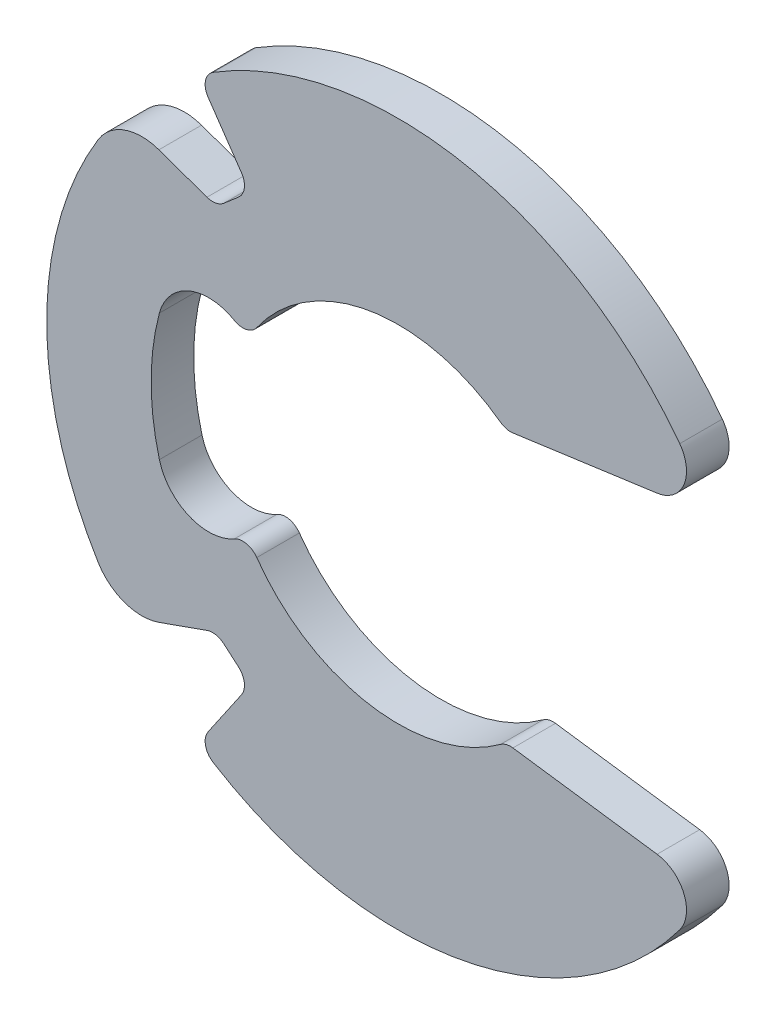
ISO-10303-21;
HEADER;
FILE_DESCRIPTION(('STEP AP214'),'2;1');
FILE_NAME('part.step','',(''),(''),'','','');
FILE_SCHEMA(('AUTOMOTIVE_DESIGN { 1 0 10303 214 1 1 1 1 }'));
ENDSEC;
DATA;
#1=APPLICATION_CONTEXT('core data for automotive mechanical design processes');
#2=APPLICATION_PROTOCOL_DEFINITION('international standard','automotive_design',2000,#1);
#3=PRODUCT_CONTEXT('',#1,'mechanical');
#4=PRODUCT('Part','Part','',(#3));
#5=PRODUCT_RELATED_PRODUCT_CATEGORY('part','',(#4));
#6=PRODUCT_DEFINITION_FORMATION('','',#4);
#7=PRODUCT_DEFINITION_CONTEXT('part definition',#1,'design');
#8=PRODUCT_DEFINITION('design','',#6,#7);
#9=PRODUCT_DEFINITION_SHAPE('','',#8);
#10=(LENGTH_UNIT() NAMED_UNIT(*) SI_UNIT(.MILLI.,.METRE.));
#11=(NAMED_UNIT(*) PLANE_ANGLE_UNIT() SI_UNIT($,.RADIAN.));
#12=(NAMED_UNIT(*) SI_UNIT($,.STERADIAN.) SOLID_ANGLE_UNIT());
#13=UNCERTAINTY_MEASURE_WITH_UNIT(LENGTH_MEASURE(1.E-05),#10,'distance_accuracy_value','');
#14=(GEOMETRIC_REPRESENTATION_CONTEXT(3) GLOBAL_UNCERTAINTY_ASSIGNED_CONTEXT((#13)) GLOBAL_UNIT_ASSIGNED_CONTEXT((#10,
#11,#12)) REPRESENTATION_CONTEXT('',''));
#15=CARTESIAN_POINT('',(0.,0.,0.));
#16=DIRECTION('',(0.,0.,1.));
#17=DIRECTION('',(1.,0.,0.));
#18=AXIS2_PLACEMENT_3D('',#15,#16,#17);
#19=CARTESIAN_POINT('',(0.,0.,1.27));
#20=DIRECTION('',(0.,0.,-1.));
#21=DIRECTION('',(-1.,0.,0.));
#22=AXIS2_PLACEMENT_3D('',#19,#20,#21);
#23=PLANE('',#22);
#24=CARTESIAN_POINT('',(7.57687706687955,-5.66664946537147,1.27));
#25=DIRECTION('',(0.,0.,-1.));
#26=DIRECTION('',(-1.,0.,0.));
#27=AXIS2_PLACEMENT_3D('',#24,#25,#26);
#28=CIRCLE('',#27,1.016);
#29=CARTESIAN_POINT('',(7.71621548730133,-4.66024954258016,1.27));
#30=VERTEX_POINT('',#29);
#31=CARTESIAN_POINT('',(8.39050144990017,-6.27514873682076,1.27));
#32=VERTEX_POINT('',#31);
#33=EDGE_CURVE('E483',#30,#32,#28,.T.);
#34=ORIENTED_EDGE('',*,*,#33,.F.);
#35=DIRECTION('',(0.990551105109562,-0.137144114588364,0.));
#36=VECTOR('',#35,1.);
#37=CARTESIAN_POINT('',(0.,-3.59192148204873,1.27));
#38=LINE('',#37,#36);
#39=CARTESIAN_POINT('',(3.41825205926127,-4.06518646523744,1.27));
#40=VERTEX_POINT('',#39);
#41=EDGE_CURVE('E485',#30,#40,#38,.F.);
#42=ORIENTED_EDGE('',*,*,#41,.T.);
#43=CARTESIAN_POINT('',(3.34858284905039,-4.5683864266331,1.27));
#44=DIRECTION('',(0.,0.,-1.));
#45=DIRECTION('',(-1.,0.,0.));
#46=AXIS2_PLACEMENT_3D('',#43,#44,#45);
#47=CIRCLE('',#46,0.508);
#48=CARTESIAN_POINT('',(3.04826151729699,-4.15866567088125,1.27));
#49=VERTEX_POINT('',#48);
#50=EDGE_CURVE('E19',#49,#40,#47,.T.);
#51=ORIENTED_EDGE('',*,*,#50,.F.);
#52=CARTESIAN_POINT('',(0.,0.,1.27));
#53=DIRECTION('',(0.,0.,-1.));
#54=DIRECTION('',(-1.,0.,0.));
#55=AXIS2_PLACEMENT_3D('',#52,#53,#54);
#56=CIRCLE('',#55,5.1562);
#57=CARTESIAN_POINT('',(-4.21618561440546,-2.96819428354689,1.27));
#58=VERTEX_POINT('',#57);
#59=EDGE_CURVE('E387',#49,#58,#56,.T.);
#60=ORIENTED_EDGE('',*,*,#59,.T.);
#61=CARTESIAN_POINT('',(-4.63157335966707,-3.26062721788648,1.27));
#62=DIRECTION('',(0.,0.,-1.));
#63=DIRECTION('',(-1.,0.,0.));
#64=AXIS2_PLACEMENT_3D('',#61,#62,#63);
#65=CIRCLE('',#64,0.508);
#66=CARTESIAN_POINT('',(-4.88521418696267,-2.82047913970278,1.27));
#67=VERTEX_POINT('',#66);
#68=EDGE_CURVE('E391',#67,#58,#65,.T.);
#69=ORIENTED_EDGE('',*,*,#68,.F.);
#70=CARTESIAN_POINT('',(-5.64613666884946,-1.50003490515168,1.27));
#71=DIRECTION('',(0.,0.,1.));
#72=DIRECTION('',(1.,0.,0.));
#73=AXIS2_PLACEMENT_3D('',#70,#71,#72);
#74=CIRCLE('',#73,1.524);
#75=CARTESIAN_POINT('',(-7.1190418868102,-1.89134835866951,1.27));
#76=VERTEX_POINT('',#75);
#77=EDGE_CURVE('E395',#67,#76,#74,.F.);
#78=ORIENTED_EDGE('',*,*,#77,.T.);
#79=CARTESIAN_POINT('',(0.,0.,1.27));
#80=DIRECTION('',(0.,0.,1.));
#81=DIRECTION('',(1.,0.,0.));
#82=AXIS2_PLACEMENT_3D('',#79,#80,#81);
#83=CIRCLE('',#82,7.366);
#84=CARTESIAN_POINT('',(-7.1190418868102,1.89134835866951,1.27));
#85=VERTEX_POINT('',#84);
#86=EDGE_CURVE('E400',#76,#85,#83,.F.);
#87=ORIENTED_EDGE('',*,*,#86,.T.);
#88=CARTESIAN_POINT('',(-5.64613666884946,1.50003490515168,1.27));
#89=DIRECTION('',(0.,0.,1.));
#90=DIRECTION('',(1.,0.,0.));
#91=AXIS2_PLACEMENT_3D('',#88,#89,#90);
#92=CIRCLE('',#91,1.524);
#93=CARTESIAN_POINT('',(-4.88521418696268,2.82047913970279,1.27));
#94=VERTEX_POINT('',#93);
#95=EDGE_CURVE('E405',#85,#94,#92,.F.);
#96=ORIENTED_EDGE('',*,*,#95,.T.);
#97=CARTESIAN_POINT('',(-4.63157335966708,3.26062721788649,1.27));
#98=DIRECTION('',(0.,0.,1.));
#99=DIRECTION('',(1.,0.,0.));
#100=AXIS2_PLACEMENT_3D('',#97,#98,#99);
#101=CIRCLE('',#100,0.508);
#102=CARTESIAN_POINT('',(-4.21618561440546,2.96819428354689,1.27));
#103=VERTEX_POINT('',#102);
#104=EDGE_CURVE('E408',#103,#94,#101,.F.);
#105=ORIENTED_EDGE('',*,*,#104,.F.);
#106=CARTESIAN_POINT('',(0.,0.,1.27));
#107=DIRECTION('',(0.,0.,-1.));
#108=DIRECTION('',(-1.,0.,0.));
#109=AXIS2_PLACEMENT_3D('',#106,#107,#108);
#110=CIRCLE('',#109,5.1562);
#111=CARTESIAN_POINT('',(3.048261517297,4.15866567088126,1.27));
#112=VERTEX_POINT('',#111);
#113=EDGE_CURVE('E413',#103,#112,#110,.T.);
#114=ORIENTED_EDGE('',*,*,#113,.T.);
#115=CARTESIAN_POINT('',(3.3485828490504,4.5683864266331,1.27));
#116=DIRECTION('',(0.,0.,-1.));
#117=DIRECTION('',(-1.,0.,0.));
#118=AXIS2_PLACEMENT_3D('',#115,#116,#117);
#119=CIRCLE('',#118,0.508);
#120=CARTESIAN_POINT('',(3.41825205926129,4.06518646523745,1.27));
#121=VERTEX_POINT('',#120);
#122=EDGE_CURVE('E418',#121,#112,#119,.T.);
#123=ORIENTED_EDGE('',*,*,#122,.F.);
#124=DIRECTION('',(-0.990551105109562,-0.137144114588364,0.));
#125=VECTOR('',#124,1.);
#126=CARTESIAN_POINT('',(11.2983179723503,5.15619999999999,1.27));
#127=LINE('',#126,#125);
#128=CARTESIAN_POINT('',(7.71621548730134,4.66024954258016,1.27));
#129=VERTEX_POINT('',#128);
#130=EDGE_CURVE('E426',#121,#129,#127,.F.);
#131=ORIENTED_EDGE('',*,*,#130,.T.);
#132=CARTESIAN_POINT('',(7.57687706687956,5.66664946537147,1.27));
#133=DIRECTION('',(0.,0.,-1.));
#134=DIRECTION('',(-1.,0.,0.));
#135=AXIS2_PLACEMENT_3D('',#132,#133,#134);
#136=CIRCLE('',#135,1.016);
#137=CARTESIAN_POINT('',(8.39050144990018,6.27514873682076,1.27));
#138=VERTEX_POINT('',#137);
#139=EDGE_CURVE('E422',#138,#129,#136,.T.);
#140=ORIENTED_EDGE('',*,*,#139,.F.);
#141=CARTESIAN_POINT('',(0.,0.,1.27));
#142=DIRECTION('',(0.,0.,-1.));
#143=DIRECTION('',(-1.,0.,0.));
#144=AXIS2_PLACEMENT_3D('',#141,#142,#143);
#145=CIRCLE('',#144,10.4775);
#146=CARTESIAN_POINT('',(-5.51465485817056,8.90879273780999,1.27));
#147=VERTEX_POINT('',#146);
#148=EDGE_CURVE('E428',#147,#138,#145,.T.);
#149=ORIENTED_EDGE('',*,*,#148,.F.);
#150=CARTESIAN_POINT('',(-5.24727765292592,8.47685127173435,1.27));
#151=DIRECTION('',(0.,0.,-1.));
#152=DIRECTION('',(-1.,0.,0.));
#153=AXIS2_PLACEMENT_3D('',#150,#151,#152);
#154=CIRCLE('',#153,0.508);
#155=CARTESIAN_POINT('',(-5.6664647231543,8.18989099547063,1.27));
#156=VERTEX_POINT('',#155);
#157=EDGE_CURVE('E432',#156,#147,#154,.T.);
#158=ORIENTED_EDGE('',*,*,#157,.F.);
#159=DIRECTION('',(0.564882433590001,-0.825171398087354,0.));
#160=VECTOR('',#159,1.);
#161=CARTESIAN_POINT('',(-7.96096866359448,11.541666359447,1.27));
#162=LINE('',#161,#160);
#163=CARTESIAN_POINT('',(-4.67174469224146,6.73681957776462,1.27));
#164=VERTEX_POINT('',#163);
#165=EDGE_CURVE('E498',#164,#156,#162,.F.);
#166=ORIENTED_EDGE('',*,*,#165,.F.);
#167=CARTESIAN_POINT('',(-5.09093176246983,6.4498593015009,1.27));
#168=DIRECTION('',(0.,0.,-1.));
#169=DIRECTION('',(-1.,0.,0.));
#170=AXIS2_PLACEMENT_3D('',#167,#168,#169);
#171=CIRCLE('',#170,0.508);
#172=CARTESIAN_POINT('',(-4.75923843445855,6.0650950410078,1.27000000000001));
#173=VERTEX_POINT('',#172);
#174=EDGE_CURVE('E437',#164,#173,#171,.T.);
#175=ORIENTED_EDGE('',*,*,#174,.T.);
#176=DIRECTION('',(-0.757409961600578,-0.652939622069462,0.));
#177=VECTOR('',#176,1.);
#178=CARTESIAN_POINT('',(-4.41503502304148,6.36182211981562,1.27000000000001));
#179=LINE('',#178,#177);
#180=CARTESIAN_POINT('',(-5.19974545035898,5.68534761350743,1.27000000000001));
#181=VERTEX_POINT('',#180);
#182=EDGE_CURVE('E503',#181,#173,#179,.F.);
#183=ORIENTED_EDGE('',*,*,#182,.F.);
#184=CARTESIAN_POINT('',(-5.53143877837027,6.07011187400052,1.27));
#185=DIRECTION('',(0.,0.,-1.));
#186=DIRECTION('',(-1.,0.,0.));
#187=AXIS2_PLACEMENT_3D('',#184,#185,#186);
#188=CIRCLE('',#187,0.508);
#189=CARTESIAN_POINT('',(-5.70123922502142,5.59133028672186,1.27));
#190=VERTEX_POINT('',#189);
#191=EDGE_CURVE('E442',#181,#190,#188,.T.);
#192=ORIENTED_EDGE('',*,*,#191,.T.);
#193=DIRECTION('',(-0.942483439524914,0.334252847738487,0.));
#194=VECTOR('',#193,1.);
#195=CARTESIAN_POINT('',(-5.42319262672811,5.49272073732714,1.27));
#196=LINE('',#195,#194);
#197=CARTESIAN_POINT('',(-7.13394241485243,6.09944013892937,1.27));
#198=VERTEX_POINT('',#197);
#199=EDGE_CURVE('E507',#198,#190,#196,.F.);
#200=ORIENTED_EDGE('',*,*,#199,.F.);
#201=CARTESIAN_POINT('',(-7.64334375480589,4.6630953770934,1.27));
#202=DIRECTION('',(0.,0.,-1.));
#203=DIRECTION('',(-1.,0.,0.));
#204=AXIS2_PLACEMENT_3D('',#201,#202,#203);
#205=CIRCLE('',#204,1.524);
#206=CARTESIAN_POINT('',(-8.94433843647498,5.45681373915185,1.27));
#207=VERTEX_POINT('',#206);
#208=EDGE_CURVE('E447',#207,#198,#205,.T.);
#209=ORIENTED_EDGE('',*,*,#208,.F.);
#210=CARTESIAN_POINT('',(0.,0.,1.27));
#211=DIRECTION('',(0.,0.,-1.));
#212=DIRECTION('',(-1.,0.,0.));
#213=AXIS2_PLACEMENT_3D('',#210,#211,#212);
#214=CIRCLE('',#213,10.4775);
#215=CARTESIAN_POINT('',(-8.94433843647497,-5.45681373915185,1.27));
#216=VERTEX_POINT('',#215);
#217=EDGE_CURVE('E452',#216,#207,#214,.T.);
#218=ORIENTED_EDGE('',*,*,#217,.F.);
#219=CARTESIAN_POINT('',(-7.64334375480588,-4.6630953770934,1.27));
#220=DIRECTION('',(0.,0.,-1.));
#221=DIRECTION('',(-1.,0.,0.));
#222=AXIS2_PLACEMENT_3D('',#219,#220,#221);
#223=CIRCLE('',#222,1.524);
#224=CARTESIAN_POINT('',(-7.13394241485243,-6.09944013892937,1.27));
#225=VERTEX_POINT('',#224);
#226=EDGE_CURVE('E457',#225,#216,#223,.T.);
#227=ORIENTED_EDGE('',*,*,#226,.F.);
#228=DIRECTION('',(-0.942483439524914,-0.334252847738487,0.));
#229=VECTOR('',#228,1.);
#230=CARTESIAN_POINT('',(-5.42319262672811,-5.49272073732714,1.27));
#231=LINE('',#230,#229);
#232=CARTESIAN_POINT('',(-5.70123922502142,-5.59133028672186,1.27));
#233=VERTEX_POINT('',#232);
#234=EDGE_CURVE('E511',#225,#233,#231,.F.);
#235=ORIENTED_EDGE('',*,*,#234,.T.);
#236=CARTESIAN_POINT('',(-5.53143877837027,-6.07011187400052,1.27));
#237=DIRECTION('',(0.,0.,-1.));
#238=DIRECTION('',(-1.,0.,0.));
#239=AXIS2_PLACEMENT_3D('',#236,#237,#238);
#240=CIRCLE('',#239,0.508);
#241=CARTESIAN_POINT('',(-5.19974545035898,-5.68534761350743,1.27000000000001));
#242=VERTEX_POINT('',#241);
#243=EDGE_CURVE('E463',#233,#242,#240,.T.);
#244=ORIENTED_EDGE('',*,*,#243,.T.);
#245=DIRECTION('',(-0.757409961600578,0.652939622069462,0.));
#246=VECTOR('',#245,1.);
#247=CARTESIAN_POINT('',(-4.41503502304148,-6.36182211981562,1.27000000000001));
#248=LINE('',#247,#246);
#249=CARTESIAN_POINT('',(-4.75923843445855,-6.0650950410078,1.27000000000001));
#250=VERTEX_POINT('',#249);
#251=EDGE_CURVE('E514',#242,#250,#248,.F.);
#252=ORIENTED_EDGE('',*,*,#251,.T.);
#253=CARTESIAN_POINT('',(-5.09093176246983,-6.4498593015009,1.27));
#254=DIRECTION('',(0.,0.,-1.));
#255=DIRECTION('',(-1.,0.,0.));
#256=AXIS2_PLACEMENT_3D('',#253,#254,#255);
#257=CIRCLE('',#256,0.508);
#258=CARTESIAN_POINT('',(-4.67174469224146,-6.73681957776462,1.27));
#259=VERTEX_POINT('',#258);
#260=EDGE_CURVE('E468',#250,#259,#257,.T.);
#261=ORIENTED_EDGE('',*,*,#260,.T.);
#262=DIRECTION('',(0.56488243359,0.825171398087354,0.));
#263=VECTOR('',#262,1.);
#264=CARTESIAN_POINT('',(-7.96096866359448,-11.541666359447,1.27));
#265=LINE('',#264,#263);
#266=CARTESIAN_POINT('',(-5.66646472315429,-8.18989099547062,1.27));
#267=VERTEX_POINT('',#266);
#268=EDGE_CURVE('E477',#259,#267,#265,.F.);
#269=ORIENTED_EDGE('',*,*,#268,.T.);
#270=CARTESIAN_POINT('',(-5.24727765292592,-8.47685127173434,1.27));
#271=DIRECTION('',(0.,0.,-1.));
#272=DIRECTION('',(-1.,0.,0.));
#273=AXIS2_PLACEMENT_3D('',#270,#271,#272);
#274=CIRCLE('',#273,0.508);
#275=CARTESIAN_POINT('',(-5.51465485817055,-8.90879273780997,1.27));
#276=VERTEX_POINT('',#275);
#277=EDGE_CURVE('E473',#276,#267,#274,.T.);
#278=ORIENTED_EDGE('',*,*,#277,.F.);
#279=CARTESIAN_POINT('',(0.,0.,1.27));
#280=DIRECTION('',(0.,0.,-1.));
#281=DIRECTION('',(-1.,0.,0.));
#282=AXIS2_PLACEMENT_3D('',#279,#280,#281);
#283=CIRCLE('',#282,10.4775);
#284=EDGE_CURVE('E479',#32,#276,#283,.T.);
#285=ORIENTED_EDGE('',*,*,#284,.F.);
#286=EDGE_LOOP('',(#34,#42,#51,#60,#69,#78,#87,#96,#105,#114,#123,#131,#140,#149,#158,#166,#175,
#183,#192,#200,#209,#218,#227,#235,#244,#252,#261,#269,#278,#285));
#287=FACE_BOUND('',#286,.T.);
#288=ADVANCED_FACE('F16',(#287),#23,.F.);
#289=CARTESIAN_POINT('',(0.,-3.59192148204873,-28.9774986298856));
#290=DIRECTION('',(-0.137144114588364,-0.990551105109562,0.));
#291=DIRECTION('',(0.990551105109562,-0.137144114588364,0.));
#292=AXIS2_PLACEMENT_3D('',#289,#290,#291);
#293=PLANE('',#292);
#294=DIRECTION('',(0.,0.,-1.));
#295=VECTOR('',#294,1.);
#296=CARTESIAN_POINT('',(7.71621548730133,-4.66024954258016,1.27));
#297=LINE('',#296,#295);
#298=CARTESIAN_POINT('',(7.71621548730133,-4.66024954258016,0.));
#299=VERTEX_POINT('',#298);
#300=EDGE_CURVE('E283',#299,#30,#297,.F.);
#301=ORIENTED_EDGE('',*,*,#300,.F.);
#302=DIRECTION('',(0.990551105109562,-0.137144114588363,0.));
#303=VECTOR('',#302,1.);
#304=CARTESIAN_POINT('',(3.41825205926127,-4.06518646523744,0.));
#305=LINE('',#304,#303);
#306=CARTESIAN_POINT('',(3.41825205926127,-4.06518646523744,0.));
#307=VERTEX_POINT('',#306);
#308=EDGE_CURVE('E278',#307,#299,#305,.T.);
#309=ORIENTED_EDGE('',*,*,#308,.F.);
#310=DIRECTION('',(0.,0.,-1.));
#311=VECTOR('',#310,1.);
#312=CARTESIAN_POINT('',(3.41825205926127,-4.06518646523744,1.27));
#313=LINE('',#312,#311);
#314=EDGE_CURVE('E281',#40,#307,#313,.T.);
#315=ORIENTED_EDGE('',*,*,#314,.F.);
#316=ORIENTED_EDGE('',*,*,#41,.F.);
#317=EDGE_LOOP('',(#301,#309,#315,#316));
#318=FACE_BOUND('',#317,.T.);
#319=ADVANCED_FACE('F279',(#318),#293,.F.);
#320=CARTESIAN_POINT('',(7.57687706687955,-5.66664946537147,1.27));
#321=DIRECTION('',(0.,0.,-1.));
#322=DIRECTION('',(-1.,0.,0.));
#323=AXIS2_PLACEMENT_3D('',#320,#321,#322);
#324=CYLINDRICAL_SURFACE('',#323,1.016);
#325=CARTESIAN_POINT('',(7.57687706687955,-5.66664946537147,0.));
#326=DIRECTION('',(0.,0.,-1.));
#327=DIRECTION('',(-1.,0.,0.));
#328=AXIS2_PLACEMENT_3D('',#325,#326,#327);
#329=CIRCLE('',#328,1.016);
#330=CARTESIAN_POINT('',(8.39050144990017,-6.27514873682076,0.));
#331=VERTEX_POINT('',#330);
#332=EDGE_CURVE('E288',#299,#331,#329,.T.);
#333=ORIENTED_EDGE('',*,*,#332,.F.);
#334=ORIENTED_EDGE('',*,*,#300,.T.);
#335=ORIENTED_EDGE('',*,*,#33,.T.);
#336=DIRECTION('',(0.,0.,-1.));
#337=VECTOR('',#336,1.);
#338=CARTESIAN_POINT('',(8.39050144990017,-6.27514873682076,1.27));
#339=LINE('',#338,#337);
#340=EDGE_CURVE('E482',#331,#32,#339,.F.);
#341=ORIENTED_EDGE('',*,*,#340,.F.);
#342=EDGE_LOOP('',(#333,#334,#335,#341));
#343=FACE_BOUND('',#342,.T.);
#344=ADVANCED_FACE('F537',(#343),#324,.T.);
#345=CARTESIAN_POINT('',(0.,0.,1.27));
#346=DIRECTION('',(0.,0.,-1.));
#347=DIRECTION('',(-1.,0.,0.));
#348=AXIS2_PLACEMENT_3D('',#345,#346,#347);
#349=CYLINDRICAL_SURFACE('',#348,10.4775);
#350=ORIENTED_EDGE('',*,*,#284,.T.);
#351=DIRECTION('',(0.,0.,-1.));
#352=VECTOR('',#351,1.);
#353=CARTESIAN_POINT('',(-5.51465485817055,-8.90879273780998,1.27));
#354=LINE('',#353,#352);
#355=CARTESIAN_POINT('',(-5.51465485817055,-8.90879273780997,0.));
#356=VERTEX_POINT('',#355);
#357=EDGE_CURVE('E478',#356,#276,#354,.F.);
#358=ORIENTED_EDGE('',*,*,#357,.F.);
#359=CARTESIAN_POINT('',(0.,0.,0.));
#360=DIRECTION('',(0.,0.,-1.));
#361=DIRECTION('',(-1.,0.,0.));
#362=AXIS2_PLACEMENT_3D('',#359,#360,#361);
#363=CIRCLE('',#362,10.4775);
#364=EDGE_CURVE('E381',#331,#356,#363,.T.);
#365=ORIENTED_EDGE('',*,*,#364,.F.);
#366=ORIENTED_EDGE('',*,*,#340,.T.);
#367=EDGE_LOOP('',(#350,#358,#365,#366));
#368=FACE_BOUND('',#367,.T.);
#369=ADVANCED_FACE('F536',(#368),#349,.T.);
#370=CARTESIAN_POINT('',(-5.24727765292592,-8.47685127173434,1.27));
#371=DIRECTION('',(0.,0.,-1.));
#372=DIRECTION('',(-1.,0.,0.));
#373=AXIS2_PLACEMENT_3D('',#370,#371,#372);
#374=CYLINDRICAL_SURFACE('',#373,0.508);
#375=DIRECTION('',(0.,0.,1.));
#376=VECTOR('',#375,1.);
#377=CARTESIAN_POINT('',(-5.66646472315429,-8.18989099547062,-28.9619533727259));
#378=LINE('',#377,#376);
#379=CARTESIAN_POINT('',(-5.6664647231543,-8.18989099547062,0.));
#380=VERTEX_POINT('',#379);
#381=EDGE_CURVE('E472',#267,#380,#378,.F.);
#382=ORIENTED_EDGE('',*,*,#381,.T.);
#383=CARTESIAN_POINT('',(-5.24727765292592,-8.47685127173434,0.));
#384=DIRECTION('',(0.,0.,-1.));
#385=DIRECTION('',(-1.,0.,0.));
#386=AXIS2_PLACEMENT_3D('',#383,#384,#385);
#387=CIRCLE('',#386,0.508);
#388=EDGE_CURVE('E378',#356,#380,#387,.T.);
#389=ORIENTED_EDGE('',*,*,#388,.F.);
#390=ORIENTED_EDGE('',*,*,#357,.T.);
#391=ORIENTED_EDGE('',*,*,#277,.T.);
#392=EDGE_LOOP('',(#382,#389,#390,#391));
#393=FACE_BOUND('',#392,.T.);
#394=ADVANCED_FACE('F539',(#393),#374,.T.);
#395=CARTESIAN_POINT('',(-7.96096866359448,-11.541666359447,-28.9619533727259));
#396=DIRECTION('',(0.825171398087354,-0.56488243359,0.));
#397=DIRECTION('',(0.56488243359,0.825171398087354,0.));
#398=AXIS2_PLACEMENT_3D('',#395,#396,#397);
#399=PLANE('',#398);
#400=ORIENTED_EDGE('',*,*,#381,.F.);
#401=ORIENTED_EDGE('',*,*,#268,.F.);
#402=DIRECTION('',(0.,0.,-1.));
#403=VECTOR('',#402,1.);
#404=CARTESIAN_POINT('',(-4.67174469224146,-6.73681957776462,-28.9619533727259));
#405=LINE('',#404,#403);
#406=CARTESIAN_POINT('',(-4.67174469224146,-6.73681957776462,0.));
#407=VERTEX_POINT('',#406);
#408=EDGE_CURVE('E471',#259,#407,#405,.T.);
#409=ORIENTED_EDGE('',*,*,#408,.T.);
#410=DIRECTION('',(0.564882433590003,0.825171398087353,0.));
#411=VECTOR('',#410,1.);
#412=CARTESIAN_POINT('',(-5.6664647231543,-8.18989099547062,0.));
#413=LINE('',#412,#411);
#414=EDGE_CURVE('E377',#380,#407,#413,.T.);
#415=ORIENTED_EDGE('',*,*,#414,.F.);
#416=EDGE_LOOP('',(#400,#401,#409,#415));
#417=FACE_BOUND('',#416,.T.);
#418=ADVANCED_FACE('F541',(#417),#399,.F.);
#419=CARTESIAN_POINT('',(-5.09093176246983,-6.4498593015009,-28.9619533727259));
#420=DIRECTION('',(0.,0.,-1.));
#421=DIRECTION('',(-1.,0.,0.));
#422=AXIS2_PLACEMENT_3D('',#419,#420,#421);
#423=CYLINDRICAL_SURFACE('',#422,0.508);
#424=ORIENTED_EDGE('',*,*,#408,.F.);
#425=ORIENTED_EDGE('',*,*,#260,.F.);
#426=DIRECTION('',(0.,0.,1.));
#427=VECTOR('',#426,1.);
#428=CARTESIAN_POINT('',(-4.75923843445855,-6.0650950410078,-28.9619533727259));
#429=LINE('',#428,#427);
#430=CARTESIAN_POINT('',(-4.75923843445855,-6.0650950410078,0.));
#431=VERTEX_POINT('',#430);
#432=EDGE_CURVE('E467',#250,#431,#429,.F.);
#433=ORIENTED_EDGE('',*,*,#432,.T.);
#434=CARTESIAN_POINT('',(-5.09093176246983,-6.4498593015009,0.));
#435=DIRECTION('',(0.,0.,-1.));
#436=DIRECTION('',(-1.,0.,0.));
#437=AXIS2_PLACEMENT_3D('',#434,#435,#436);
#438=CIRCLE('',#437,0.508);
#439=EDGE_CURVE('E373',#407,#431,#438,.F.);
#440=ORIENTED_EDGE('',*,*,#439,.F.);
#441=EDGE_LOOP('',(#424,#425,#433,#440));
#442=FACE_BOUND('',#441,.T.);
#443=ADVANCED_FACE('F608',(#442),#423,.F.);
#444=CARTESIAN_POINT('',(-4.41503502304148,-6.36182211981562,-28.9619533727259));
#445=DIRECTION('',(0.652939622069462,0.757409961600578,0.));
#446=DIRECTION('',(-0.757409961600578,0.652939622069462,0.));
#447=AXIS2_PLACEMENT_3D('',#444,#445,#446);
#448=PLANE('',#447);
#449=ORIENTED_EDGE('',*,*,#432,.F.);
#450=ORIENTED_EDGE('',*,*,#251,.F.);
#451=DIRECTION('',(0.,0.,-1.));
#452=VECTOR('',#451,1.);
#453=CARTESIAN_POINT('',(-5.19974545035899,-5.68534761350743,-28.9619533727259));
#454=LINE('',#453,#452);
#455=CARTESIAN_POINT('',(-5.19974545035898,-5.68534761350743,0.));
#456=VERTEX_POINT('',#455);
#457=EDGE_CURVE('E466',#242,#456,#454,.T.);
#458=ORIENTED_EDGE('',*,*,#457,.T.);
#459=DIRECTION('',(-0.757409961600581,0.652939622069458,0.));
#460=VECTOR('',#459,1.);
#461=CARTESIAN_POINT('',(-4.75923843445854,-6.0650950410078,0.));
#462=LINE('',#461,#460);
#463=EDGE_CURVE('E372',#431,#456,#462,.T.);
#464=ORIENTED_EDGE('',*,*,#463,.F.);
#465=EDGE_LOOP('',(#449,#450,#458,#464));
#466=FACE_BOUND('',#465,.T.);
#467=ADVANCED_FACE('F612',(#466),#448,.F.);
#468=CARTESIAN_POINT('',(-5.53143877837027,-6.07011187400052,-28.9619533727259));
#469=DIRECTION('',(0.,0.,-1.));
#470=DIRECTION('',(-1.,0.,0.));
#471=AXIS2_PLACEMENT_3D('',#468,#469,#470);
#472=CYLINDRICAL_SURFACE('',#471,0.508);
#473=ORIENTED_EDGE('',*,*,#457,.F.);
#474=ORIENTED_EDGE('',*,*,#243,.F.);
#475=DIRECTION('',(0.,0.,1.));
#476=VECTOR('',#475,1.);
#477=CARTESIAN_POINT('',(-5.70123922502142,-5.59133028672186,-28.9619533727259));
#478=LINE('',#477,#476);
#479=CARTESIAN_POINT('',(-5.70123922502142,-5.59133028672186,0.));
#480=VERTEX_POINT('',#479);
#481=EDGE_CURVE('E462',#233,#480,#478,.F.);
#482=ORIENTED_EDGE('',*,*,#481,.T.);
#483=CARTESIAN_POINT('',(-5.53143877837027,-6.07011187400052,0.));
#484=DIRECTION('',(0.,0.,-1.));
#485=DIRECTION('',(-1.,0.,0.));
#486=AXIS2_PLACEMENT_3D('',#483,#484,#485);
#487=CIRCLE('',#486,0.508);
#488=EDGE_CURVE('E368',#456,#480,#487,.F.);
#489=ORIENTED_EDGE('',*,*,#488,.F.);
#490=EDGE_LOOP('',(#473,#474,#482,#489));
#491=FACE_BOUND('',#490,.T.);
#492=ADVANCED_FACE('F620',(#491),#472,.F.);
#493=CARTESIAN_POINT('',(-5.42319262672811,-5.49272073732714,-28.9619533727259));
#494=DIRECTION('',(-0.334252847738487,0.942483439524914,0.));
#495=DIRECTION('',(-0.942483439524914,-0.334252847738487,0.));
#496=AXIS2_PLACEMENT_3D('',#493,#494,#495);
#497=PLANE('',#496);
#498=ORIENTED_EDGE('',*,*,#481,.F.);
#499=ORIENTED_EDGE('',*,*,#234,.F.);
#500=DIRECTION('',(0.,0.,-1.));
#501=VECTOR('',#500,1.);
#502=CARTESIAN_POINT('',(-7.13394241485243,-6.09944013892937,1.27));
#503=LINE('',#502,#501);
#504=CARTESIAN_POINT('',(-7.13394241485243,-6.09944013892937,0.));
#505=VERTEX_POINT('',#504);
#506=EDGE_CURVE('E461',#505,#225,#503,.F.);
#507=ORIENTED_EDGE('',*,*,#506,.F.);
#508=DIRECTION('',(-0.942483439524914,-0.334252847738488,0.));
#509=VECTOR('',#508,1.);
#510=CARTESIAN_POINT('',(-5.70123922502142,-5.59133028672186,0.));
#511=LINE('',#510,#509);
#512=EDGE_CURVE('E367',#480,#505,#511,.T.);
#513=ORIENTED_EDGE('',*,*,#512,.F.);
#514=EDGE_LOOP('',(#498,#499,#507,#513));
#515=FACE_BOUND('',#514,.T.);
#516=ADVANCED_FACE('F625',(#515),#497,.F.);
#517=CARTESIAN_POINT('',(-7.64334375480588,-4.6630953770934,1.27));
#518=DIRECTION('',(0.,0.,-1.));
#519=DIRECTION('',(-1.,0.,0.));
#520=AXIS2_PLACEMENT_3D('',#517,#518,#519);
#521=CYLINDRICAL_SURFACE('',#520,1.524);
#522=CARTESIAN_POINT('',(-7.64334375480588,-4.6630953770934,0.));
#523=DIRECTION('',(0.,0.,-1.));
#524=DIRECTION('',(-1.,0.,0.));
#525=AXIS2_PLACEMENT_3D('',#522,#523,#524);
#526=CIRCLE('',#525,1.524);
#527=CARTESIAN_POINT('',(-8.94433843647497,-5.45681373915185,0.));
#528=VERTEX_POINT('',#527);
#529=EDGE_CURVE('E363',#505,#528,#526,.T.);
#530=ORIENTED_EDGE('',*,*,#529,.F.);
#531=ORIENTED_EDGE('',*,*,#506,.T.);
#532=ORIENTED_EDGE('',*,*,#226,.T.);
#533=DIRECTION('',(0.,0.,-1.));
#534=VECTOR('',#533,1.);
#535=CARTESIAN_POINT('',(-8.94433843647497,-5.45681373915185,1.27));
#536=LINE('',#535,#534);
#537=EDGE_CURVE('E456',#528,#216,#536,.F.);
#538=ORIENTED_EDGE('',*,*,#537,.F.);
#539=EDGE_LOOP('',(#530,#531,#532,#538));
#540=FACE_BOUND('',#539,.T.);
#541=ADVANCED_FACE('F711',(#540),#521,.T.);
#542=CARTESIAN_POINT('',(0.,0.,1.27));
#543=DIRECTION('',(0.,0.,-1.));
#544=DIRECTION('',(-1.,0.,0.));
#545=AXIS2_PLACEMENT_3D('',#542,#543,#544);
#546=CYLINDRICAL_SURFACE('',#545,10.4775);
#547=DIRECTION('',(0.,0.,-1.));
#548=VECTOR('',#547,1.);
#549=CARTESIAN_POINT('',(-8.94433843647498,5.45681373915185,1.27));
#550=LINE('',#549,#548);
#551=CARTESIAN_POINT('',(-8.94433843647498,5.45681373915185,0.));
#552=VERTEX_POINT('',#551);
#553=EDGE_CURVE('E451',#552,#207,#550,.F.);
#554=ORIENTED_EDGE('',*,*,#553,.F.);
#555=CARTESIAN_POINT('',(0.,0.,0.));
#556=DIRECTION('',(0.,0.,-1.));
#557=DIRECTION('',(-1.,0.,0.));
#558=AXIS2_PLACEMENT_3D('',#555,#556,#557);
#559=CIRCLE('',#558,10.4775);
#560=EDGE_CURVE('E360',#528,#552,#559,.T.);
#561=ORIENTED_EDGE('',*,*,#560,.F.);
#562=ORIENTED_EDGE('',*,*,#537,.T.);
#563=ORIENTED_EDGE('',*,*,#217,.T.);
#564=EDGE_LOOP('',(#554,#561,#562,#563));
#565=FACE_BOUND('',#564,.T.);
#566=ADVANCED_FACE('F709',(#565),#546,.T.);
#567=CARTESIAN_POINT('',(-7.64334375480589,4.6630953770934,1.27));
#568=DIRECTION('',(0.,0.,-1.));
#569=DIRECTION('',(-1.,0.,0.));
#570=AXIS2_PLACEMENT_3D('',#567,#568,#569);
#571=CYLINDRICAL_SURFACE('',#570,1.524);
#572=CARTESIAN_POINT('',(-7.64334375480589,4.6630953770934,0.));
#573=DIRECTION('',(0.,0.,-1.));
#574=DIRECTION('',(-1.,0.,0.));
#575=AXIS2_PLACEMENT_3D('',#572,#573,#574);
#576=CIRCLE('',#575,1.524);
#577=CARTESIAN_POINT('',(-7.13394241485243,6.09944013892937,0.));
#578=VERTEX_POINT('',#577);
#579=EDGE_CURVE('E356',#552,#578,#576,.T.);
#580=ORIENTED_EDGE('',*,*,#579,.F.);
#581=ORIENTED_EDGE('',*,*,#553,.T.);
#582=ORIENTED_EDGE('',*,*,#208,.T.);
#583=DIRECTION('',(0.,0.,1.));
#584=VECTOR('',#583,1.);
#585=CARTESIAN_POINT('',(-7.13394241485243,6.09944013892937,-28.9619533727259));
#586=LINE('',#585,#584);
#587=EDGE_CURVE('E446',#578,#198,#586,.T.);
#588=ORIENTED_EDGE('',*,*,#587,.F.);
#589=EDGE_LOOP('',(#580,#581,#582,#588));
#590=FACE_BOUND('',#589,.T.);
#591=ADVANCED_FACE('F705',(#590),#571,.T.);
#592=CARTESIAN_POINT('',(-5.42319262672811,5.49272073732714,-28.9619533727259));
#593=DIRECTION('',(0.334252847738487,0.942483439524914,0.));
#594=DIRECTION('',(-0.942483439524914,0.334252847738487,0.));
#595=AXIS2_PLACEMENT_3D('',#592,#593,#594);
#596=PLANE('',#595);
#597=DIRECTION('',(0.942483439524914,-0.334252847738487,0.));
#598=VECTOR('',#597,1.);
#599=CARTESIAN_POINT('',(-7.13394241485243,6.09944013892937,0.));
#600=LINE('',#599,#598);
#601=CARTESIAN_POINT('',(-5.70123922502142,5.59133028672186,0.));
#602=VERTEX_POINT('',#601);
#603=EDGE_CURVE('E355',#578,#602,#600,.T.);
#604=ORIENTED_EDGE('',*,*,#603,.F.);
#605=ORIENTED_EDGE('',*,*,#587,.T.);
#606=ORIENTED_EDGE('',*,*,#199,.T.);
#607=DIRECTION('',(0.,0.,-1.));
#608=VECTOR('',#607,1.);
#609=CARTESIAN_POINT('',(-5.70123922502142,5.59133028672186,-28.9619533727259));
#610=LINE('',#609,#608);
#611=EDGE_CURVE('E445',#190,#602,#610,.T.);
#612=ORIENTED_EDGE('',*,*,#611,.T.);
#613=EDGE_LOOP('',(#604,#605,#606,#612));
#614=FACE_BOUND('',#613,.T.);
#615=ADVANCED_FACE('F702',(#614),#596,.T.);
#616=CARTESIAN_POINT('',(-5.53143877837027,6.07011187400052,-28.9619533727259));
#617=DIRECTION('',(0.,0.,-1.));
#618=DIRECTION('',(-1.,0.,0.));
#619=AXIS2_PLACEMENT_3D('',#616,#617,#618);
#620=CYLINDRICAL_SURFACE('',#619,0.508);
#621=ORIENTED_EDGE('',*,*,#611,.F.);
#622=ORIENTED_EDGE('',*,*,#191,.F.);
#623=DIRECTION('',(0.,0.,1.));
#624=VECTOR('',#623,1.);
#625=CARTESIAN_POINT('',(-5.19974545035898,5.68534761350743,-28.9619533727259));
#626=LINE('',#625,#624);
#627=CARTESIAN_POINT('',(-5.19974545035898,5.68534761350743,0.));
#628=VERTEX_POINT('',#627);
#629=EDGE_CURVE('E441',#628,#181,#626,.T.);
#630=ORIENTED_EDGE('',*,*,#629,.F.);
#631=CARTESIAN_POINT('',(-5.53143877837027,6.07011187400052,0.));
#632=DIRECTION('',(0.,0.,-1.));
#633=DIRECTION('',(-1.,0.,0.));
#634=AXIS2_PLACEMENT_3D('',#631,#632,#633);
#635=CIRCLE('',#634,0.508);
#636=EDGE_CURVE('E351',#602,#628,#635,.F.);
#637=ORIENTED_EDGE('',*,*,#636,.F.);
#638=EDGE_LOOP('',(#621,#622,#630,#637));
#639=FACE_BOUND('',#638,.T.);
#640=ADVANCED_FACE('F698',(#639),#620,.F.);
#641=CARTESIAN_POINT('',(-4.41503502304148,6.36182211981562,-28.9619533727259));
#642=DIRECTION('',(-0.652939622069462,0.757409961600578,0.));
#643=DIRECTION('',(-0.757409961600578,-0.652939622069462,0.));
#644=AXIS2_PLACEMENT_3D('',#641,#642,#643);
#645=PLANE('',#644);
#646=DIRECTION('',(0.757409961600573,0.652939622069468,0.));
#647=VECTOR('',#646,1.);
#648=CARTESIAN_POINT('',(-5.19974545035898,5.68534761350743,0.));
#649=LINE('',#648,#647);
#650=CARTESIAN_POINT('',(-4.75923843445855,6.0650950410078,0.));
#651=VERTEX_POINT('',#650);
#652=EDGE_CURVE('E350',#628,#651,#649,.T.);
#653=ORIENTED_EDGE('',*,*,#652,.F.);
#654=ORIENTED_EDGE('',*,*,#629,.T.);
#655=ORIENTED_EDGE('',*,*,#182,.T.);
#656=DIRECTION('',(0.,0.,-1.));
#657=VECTOR('',#656,1.);
#658=CARTESIAN_POINT('',(-4.75923843445855,6.0650950410078,-28.9619533727259));
#659=LINE('',#658,#657);
#660=EDGE_CURVE('E440',#173,#651,#659,.T.);
#661=ORIENTED_EDGE('',*,*,#660,.T.);
#662=EDGE_LOOP('',(#653,#654,#655,#661));
#663=FACE_BOUND('',#662,.T.);
#664=ADVANCED_FACE('F694',(#663),#645,.T.);
#665=CARTESIAN_POINT('',(-5.09093176246983,6.4498593015009,-28.9619533727259));
#666=DIRECTION('',(0.,0.,-1.));
#667=DIRECTION('',(-1.,0.,0.));
#668=AXIS2_PLACEMENT_3D('',#665,#666,#667);
#669=CYLINDRICAL_SURFACE('',#668,0.508);
#670=ORIENTED_EDGE('',*,*,#660,.F.);
#671=ORIENTED_EDGE('',*,*,#174,.F.);
#672=DIRECTION('',(0.,0.,1.));
#673=VECTOR('',#672,1.);
#674=CARTESIAN_POINT('',(-4.67174469224146,6.73681957776462,-28.9619533727259));
#675=LINE('',#674,#673);
#676=CARTESIAN_POINT('',(-4.67174469224146,6.73681957776462,0.));
#677=VERTEX_POINT('',#676);
#678=EDGE_CURVE('E502',#677,#164,#675,.T.);
#679=ORIENTED_EDGE('',*,*,#678,.F.);
#680=CARTESIAN_POINT('',(-5.09093176246983,6.4498593015009,0.));
#681=DIRECTION('',(0.,0.,-1.));
#682=DIRECTION('',(-1.,0.,0.));
#683=AXIS2_PLACEMENT_3D('',#680,#681,#682);
#684=CIRCLE('',#683,0.508);
#685=EDGE_CURVE('E346',#651,#677,#684,.F.);
#686=ORIENTED_EDGE('',*,*,#685,.F.);
#687=EDGE_LOOP('',(#670,#671,#679,#686));
#688=FACE_BOUND('',#687,.T.);
#689=ADVANCED_FACE('F690',(#688),#669,.F.);
#690=CARTESIAN_POINT('',(-7.96096866359448,11.541666359447,-28.9619533727259));
#691=DIRECTION('',(-0.825171398087354,-0.564882433590001,0.));
#692=DIRECTION('',(0.564882433590001,-0.825171398087354,0.));
#693=AXIS2_PLACEMENT_3D('',#690,#691,#692);
#694=PLANE('',#693);
#695=DIRECTION('',(-0.56488243359,0.825171398087354,0.));
#696=VECTOR('',#695,1.);
#697=CARTESIAN_POINT('',(-4.67174469224146,6.73681957776462,0.));
#698=LINE('',#697,#696);
#699=CARTESIAN_POINT('',(-5.6664647231543,8.18989099547063,0.));
#700=VERTEX_POINT('',#699);
#701=EDGE_CURVE('E345',#677,#700,#698,.T.);
#702=ORIENTED_EDGE('',*,*,#701,.F.);
#703=ORIENTED_EDGE('',*,*,#678,.T.);
#704=ORIENTED_EDGE('',*,*,#165,.T.);
#705=DIRECTION('',(0.,0.,-1.));
#706=VECTOR('',#705,1.);
#707=CARTESIAN_POINT('',(-5.6664647231543,8.18989099547063,1.27));
#708=LINE('',#707,#706);
#709=EDGE_CURVE('E436',#700,#156,#708,.F.);
#710=ORIENTED_EDGE('',*,*,#709,.F.);
#711=EDGE_LOOP('',(#702,#703,#704,#710));
#712=FACE_BOUND('',#711,.T.);
#713=ADVANCED_FACE('F686',(#712),#694,.T.);
#714=CARTESIAN_POINT('',(-5.24727765292592,8.47685127173435,1.27));
#715=DIRECTION('',(0.,0.,-1.));
#716=DIRECTION('',(-1.,0.,0.));
#717=AXIS2_PLACEMENT_3D('',#714,#715,#716);
#718=CYLINDRICAL_SURFACE('',#717,0.508);
#719=DIRECTION('',(0.,0.,-1.));
#720=VECTOR('',#719,1.);
#721=CARTESIAN_POINT('',(-5.51465485817056,8.90879273780999,1.27));
#722=LINE('',#721,#720);
#723=CARTESIAN_POINT('',(-5.51465485817056,8.90879273780999,0.));
#724=VERTEX_POINT('',#723);
#725=EDGE_CURVE('E431',#724,#147,#722,.F.);
#726=ORIENTED_EDGE('',*,*,#725,.F.);
#727=CARTESIAN_POINT('',(-5.24727765292592,8.47685127173435,0.));
#728=DIRECTION('',(0.,0.,-1.));
#729=DIRECTION('',(-1.,0.,0.));
#730=AXIS2_PLACEMENT_3D('',#727,#728,#729);
#731=CIRCLE('',#730,0.508);
#732=EDGE_CURVE('E342',#700,#724,#731,.T.);
#733=ORIENTED_EDGE('',*,*,#732,.F.);
#734=ORIENTED_EDGE('',*,*,#709,.T.);
#735=ORIENTED_EDGE('',*,*,#157,.T.);
#736=EDGE_LOOP('',(#726,#733,#734,#735));
#737=FACE_BOUND('',#736,.T.);
#738=ADVANCED_FACE('F682',(#737),#718,.T.);
#739=CARTESIAN_POINT('',(0.,0.,1.27));
#740=DIRECTION('',(0.,0.,-1.));
#741=DIRECTION('',(-1.,0.,0.));
#742=AXIS2_PLACEMENT_3D('',#739,#740,#741);
#743=CYLINDRICAL_SURFACE('',#742,10.4775);
#744=CARTESIAN_POINT('',(0.,0.,0.));
#745=DIRECTION('',(0.,0.,-1.));
#746=DIRECTION('',(-1.,0.,0.));
#747=AXIS2_PLACEMENT_3D('',#744,#745,#746);
#748=CIRCLE('',#747,10.4775);
#749=CARTESIAN_POINT('',(8.39050144990018,6.27514873682076,0.));
#750=VERTEX_POINT('',#749);
#751=EDGE_CURVE('E338',#724,#750,#748,.T.);
#752=ORIENTED_EDGE('',*,*,#751,.F.);
#753=ORIENTED_EDGE('',*,*,#725,.T.);
#754=ORIENTED_EDGE('',*,*,#148,.T.);
#755=DIRECTION('',(0.,0.,-1.));
#756=VECTOR('',#755,1.);
#757=CARTESIAN_POINT('',(8.39050144990018,6.27514873682076,1.27));
#758=LINE('',#757,#756);
#759=EDGE_CURVE('E427',#750,#138,#758,.F.);
#760=ORIENTED_EDGE('',*,*,#759,.F.);
#761=EDGE_LOOP('',(#752,#753,#754,#760));
#762=FACE_BOUND('',#761,.T.);
#763=ADVANCED_FACE('F679',(#762),#743,.T.);
#764=CARTESIAN_POINT('',(7.57687706687956,5.66664946537147,1.27));
#765=DIRECTION('',(0.,0.,-1.));
#766=DIRECTION('',(-1.,0.,0.));
#767=AXIS2_PLACEMENT_3D('',#764,#765,#766);
#768=CYLINDRICAL_SURFACE('',#767,1.016);
#769=ORIENTED_EDGE('',*,*,#139,.T.);
#770=DIRECTION('',(0.,0.,1.));
#771=VECTOR('',#770,1.);
#772=CARTESIAN_POINT('',(7.71621548730134,4.66024954258016,-28.9774986298856));
#773=LINE('',#772,#771);
#774=CARTESIAN_POINT('',(7.71621548730134,4.66024954258016,0.));
#775=VERTEX_POINT('',#774);
#776=EDGE_CURVE('E497',#129,#775,#773,.F.);
#777=ORIENTED_EDGE('',*,*,#776,.T.);
#778=CARTESIAN_POINT('',(7.57687706687956,5.66664946537147,0.));
#779=DIRECTION('',(0.,0.,-1.));
#780=DIRECTION('',(-1.,0.,0.));
#781=AXIS2_PLACEMENT_3D('',#778,#779,#780);
#782=CIRCLE('',#781,1.016);
#783=EDGE_CURVE('E334',#750,#775,#782,.T.);
#784=ORIENTED_EDGE('',*,*,#783,.F.);
#785=ORIENTED_EDGE('',*,*,#759,.T.);
#786=EDGE_LOOP('',(#769,#777,#784,#785));
#787=FACE_BOUND('',#786,.T.);
#788=ADVANCED_FACE('F676',(#787),#768,.T.);
#789=CARTESIAN_POINT('',(11.2983179723503,5.15619999999999,-28.9774986298856));
#790=DIRECTION('',(-0.137144114588364,0.990551105109562,0.));
#791=DIRECTION('',(-0.990551105109562,-0.137144114588364,0.));
#792=AXIS2_PLACEMENT_3D('',#789,#790,#791);
#793=PLANE('',#792);
#794=ORIENTED_EDGE('',*,*,#776,.F.);
#795=ORIENTED_EDGE('',*,*,#130,.F.);
#796=DIRECTION('',(0.,0.,-1.));
#797=VECTOR('',#796,1.);
#798=CARTESIAN_POINT('',(3.41825205926129,4.06518646523745,1.27));
#799=LINE('',#798,#797);
#800=CARTESIAN_POINT('',(3.41825205926129,4.06518646523745,0.));
#801=VERTEX_POINT('',#800);
#802=EDGE_CURVE('E421',#801,#121,#799,.F.);
#803=ORIENTED_EDGE('',*,*,#802,.F.);
#804=DIRECTION('',(-0.990551105109562,-0.137144114588364,0.));
#805=VECTOR('',#804,1.);
#806=CARTESIAN_POINT('',(7.71621548730134,4.66024954258016,0.));
#807=LINE('',#806,#805);
#808=EDGE_CURVE('E333',#775,#801,#807,.T.);
#809=ORIENTED_EDGE('',*,*,#808,.F.);
#810=EDGE_LOOP('',(#794,#795,#803,#809));
#811=FACE_BOUND('',#810,.T.);
#812=ADVANCED_FACE('F645',(#811),#793,.F.);
#813=CARTESIAN_POINT('',(3.3485828490504,4.5683864266331,1.27));
#814=DIRECTION('',(0.,0.,-1.));
#815=DIRECTION('',(-1.,0.,0.));
#816=AXIS2_PLACEMENT_3D('',#813,#814,#815);
#817=CYLINDRICAL_SURFACE('',#816,0.508);
#818=ORIENTED_EDGE('',*,*,#122,.T.);
#819=DIRECTION('',(0.,0.,-1.));
#820=VECTOR('',#819,1.);
#821=CARTESIAN_POINT('',(3.048261517297,4.15866567088126,1.27));
#822=LINE('',#821,#820);
#823=CARTESIAN_POINT('',(3.048261517297,4.15866567088126,0.));
#824=VERTEX_POINT('',#823);
#825=EDGE_CURVE('E417',#112,#824,#822,.T.);
#826=ORIENTED_EDGE('',*,*,#825,.T.);
#827=CARTESIAN_POINT('',(3.3485828490504,4.5683864266331,0.));
#828=DIRECTION('',(0.,0.,-1.));
#829=DIRECTION('',(-1.,0.,0.));
#830=AXIS2_PLACEMENT_3D('',#827,#828,#829);
#831=CIRCLE('',#830,0.508);
#832=EDGE_CURVE('E329',#801,#824,#831,.T.);
#833=ORIENTED_EDGE('',*,*,#832,.F.);
#834=ORIENTED_EDGE('',*,*,#802,.T.);
#835=EDGE_LOOP('',(#818,#826,#833,#834));
#836=FACE_BOUND('',#835,.T.);
#837=ADVANCED_FACE('F648',(#836),#817,.T.);
#838=CARTESIAN_POINT('',(0.,0.,1.27));
#839=DIRECTION('',(0.,0.,-1.));
#840=DIRECTION('',(-1.,0.,0.));
#841=AXIS2_PLACEMENT_3D('',#838,#839,#840);
#842=CYLINDRICAL_SURFACE('',#841,5.1562);
#843=DIRECTION('',(0.,0.,1.));
#844=VECTOR('',#843,1.);
#845=CARTESIAN_POINT('',(-4.21618561440546,2.96819428354689,1.27));
#846=LINE('',#845,#844);
#847=CARTESIAN_POINT('',(-4.21618561440546,2.96819428354689,0.));
#848=VERTEX_POINT('',#847);
#849=EDGE_CURVE('E412',#848,#103,#846,.T.);
#850=ORIENTED_EDGE('',*,*,#849,.F.);
#851=CARTESIAN_POINT('',(0.,0.,0.));
#852=DIRECTION('',(0.,0.,-1.));
#853=DIRECTION('',(-1.,0.,0.));
#854=AXIS2_PLACEMENT_3D('',#851,#852,#853);
#855=CIRCLE('',#854,5.1562);
#856=EDGE_CURVE('E325',#824,#848,#855,.F.);
#857=ORIENTED_EDGE('',*,*,#856,.F.);
#858=ORIENTED_EDGE('',*,*,#825,.F.);
#859=ORIENTED_EDGE('',*,*,#113,.F.);
#860=EDGE_LOOP('',(#850,#857,#858,#859));
#861=FACE_BOUND('',#860,.T.);
#862=ADVANCED_FACE('F652',(#861),#842,.F.);
#863=CARTESIAN_POINT('',(-4.63157335966708,3.26062721788649,1.27));
#864=DIRECTION('',(0.,0.,1.));
#865=DIRECTION('',(1.,0.,0.));
#866=AXIS2_PLACEMENT_3D('',#863,#864,#865);
#867=CYLINDRICAL_SURFACE('',#866,0.508);
#868=ORIENTED_EDGE('',*,*,#104,.T.);
#869=DIRECTION('',(0.,0.,1.));
#870=VECTOR('',#869,1.);
#871=CARTESIAN_POINT('',(-4.88521418696268,2.82047913970279,-27.5542820641455));
#872=LINE('',#871,#870);
#873=CARTESIAN_POINT('',(-4.88521418696268,2.82047913970279,0.));
#874=VERTEX_POINT('',#873);
#875=EDGE_CURVE('E404',#94,#874,#872,.F.);
#876=ORIENTED_EDGE('',*,*,#875,.T.);
#877=CARTESIAN_POINT('',(-4.63157335966708,3.26062721788649,0.));
#878=DIRECTION('',(0.,0.,1.));
#879=DIRECTION('',(1.,0.,0.));
#880=AXIS2_PLACEMENT_3D('',#877,#878,#879);
#881=CIRCLE('',#880,0.508);
#882=EDGE_CURVE('E321',#848,#874,#881,.F.);
#883=ORIENTED_EDGE('',*,*,#882,.F.);
#884=ORIENTED_EDGE('',*,*,#849,.T.);
#885=EDGE_LOOP('',(#868,#876,#883,#884));
#886=FACE_BOUND('',#885,.T.);
#887=ADVANCED_FACE('F656',(#886),#867,.T.);
#888=CARTESIAN_POINT('',(-5.64613666884946,1.50003490515168,-27.5542820641455));
#889=DIRECTION('',(0.,0.,1.));
#890=DIRECTION('',(1.,0.,0.));
#891=AXIS2_PLACEMENT_3D('',#888,#889,#890);
#892=CYLINDRICAL_SURFACE('',#891,1.524);
#893=ORIENTED_EDGE('',*,*,#875,.F.);
#894=ORIENTED_EDGE('',*,*,#95,.F.);
#895=DIRECTION('',(0.,0.,1.));
#896=VECTOR('',#895,1.);
#897=CARTESIAN_POINT('',(-7.1190418868102,1.89134835866951,-27.5542820641455));
#898=LINE('',#897,#896);
#899=CARTESIAN_POINT('',(-7.1190418868102,1.89134835866951,0.));
#900=VERTEX_POINT('',#899);
#901=EDGE_CURVE('E403',#85,#900,#898,.F.);
#902=ORIENTED_EDGE('',*,*,#901,.T.);
#903=CARTESIAN_POINT('',(-5.64613666884946,1.50003490515168,0.));
#904=DIRECTION('',(0.,0.,1.));
#905=DIRECTION('',(1.,0.,0.));
#906=AXIS2_PLACEMENT_3D('',#903,#904,#905);
#907=CIRCLE('',#906,1.524);
#908=EDGE_CURVE('E317',#874,#900,#907,.T.);
#909=ORIENTED_EDGE('',*,*,#908,.F.);
#910=EDGE_LOOP('',(#893,#894,#902,#909));
#911=FACE_BOUND('',#910,.T.);
#912=ADVANCED_FACE('F661',(#911),#892,.F.);
#913=CARTESIAN_POINT('',(0.,0.,-27.5542820641455));
#914=DIRECTION('',(0.,0.,1.));
#915=DIRECTION('',(1.,0.,0.));
#916=AXIS2_PLACEMENT_3D('',#913,#914,#915);
#917=CYLINDRICAL_SURFACE('',#916,7.366);
#918=ORIENTED_EDGE('',*,*,#901,.F.);
#919=ORIENTED_EDGE('',*,*,#86,.F.);
#920=DIRECTION('',(0.,0.,1.));
#921=VECTOR('',#920,1.);
#922=CARTESIAN_POINT('',(-7.1190418868102,-1.89134835866951,-27.5542820641455));
#923=LINE('',#922,#921);
#924=CARTESIAN_POINT('',(-7.1190418868102,-1.89134835866951,0.));
#925=VERTEX_POINT('',#924);
#926=EDGE_CURVE('E399',#76,#925,#923,.F.);
#927=ORIENTED_EDGE('',*,*,#926,.T.);
#928=CARTESIAN_POINT('',(0.,0.,0.));
#929=DIRECTION('',(0.,0.,1.));
#930=DIRECTION('',(1.,0.,0.));
#931=AXIS2_PLACEMENT_3D('',#928,#929,#930);
#932=CIRCLE('',#931,7.366);
#933=EDGE_CURVE('E313',#900,#925,#932,.T.);
#934=ORIENTED_EDGE('',*,*,#933,.F.);
#935=EDGE_LOOP('',(#918,#919,#927,#934));
#936=FACE_BOUND('',#935,.T.);
#937=ADVANCED_FACE('F665',(#936),#917,.F.);
#938=CARTESIAN_POINT('',(-5.64613666884946,-1.50003490515168,-27.5542820641455));
#939=DIRECTION('',(0.,0.,1.));
#940=DIRECTION('',(1.,0.,0.));
#941=AXIS2_PLACEMENT_3D('',#938,#939,#940);
#942=CYLINDRICAL_SURFACE('',#941,1.524);
#943=DIRECTION('',(0.,0.,-1.));
#944=VECTOR('',#943,1.);
#945=CARTESIAN_POINT('',(-4.88521418696267,-2.82047913970279,1.27));
#946=LINE('',#945,#944);
#947=CARTESIAN_POINT('',(-4.88521418696267,-2.82047913970278,0.));
#948=VERTEX_POINT('',#947);
#949=EDGE_CURVE('E390',#948,#67,#946,.F.);
#950=ORIENTED_EDGE('',*,*,#949,.F.);
#951=CARTESIAN_POINT('',(-5.64613666884946,-1.50003490515168,0.));
#952=DIRECTION('',(0.,0.,1.));
#953=DIRECTION('',(1.,0.,0.));
#954=AXIS2_PLACEMENT_3D('',#951,#952,#953);
#955=CIRCLE('',#954,1.524);
#956=EDGE_CURVE('E307',#925,#948,#955,.T.);
#957=ORIENTED_EDGE('',*,*,#956,.F.);
#958=ORIENTED_EDGE('',*,*,#926,.F.);
#959=ORIENTED_EDGE('',*,*,#77,.F.);
#960=EDGE_LOOP('',(#950,#957,#958,#959));
#961=FACE_BOUND('',#960,.T.);
#962=ADVANCED_FACE('F669',(#961),#942,.F.);
#963=CARTESIAN_POINT('',(-4.63157335966707,-3.26062721788648,1.27));
#964=DIRECTION('',(0.,0.,-1.));
#965=DIRECTION('',(-1.,0.,0.));
#966=AXIS2_PLACEMENT_3D('',#963,#964,#965);
#967=CYLINDRICAL_SURFACE('',#966,0.508);
#968=CARTESIAN_POINT('',(-4.63157335966707,-3.26062721788648,0.));
#969=DIRECTION('',(0.,0.,-1.));
#970=DIRECTION('',(-1.,0.,0.));
#971=AXIS2_PLACEMENT_3D('',#968,#969,#970);
#972=CIRCLE('',#971,0.508);
#973=CARTESIAN_POINT('',(-4.21618561440546,-2.96819428354689,0.));
#974=VERTEX_POINT('',#973);
#975=EDGE_CURVE('E299',#948,#974,#972,.T.);
#976=ORIENTED_EDGE('',*,*,#975,.F.);
#977=ORIENTED_EDGE('',*,*,#949,.T.);
#978=ORIENTED_EDGE('',*,*,#68,.T.);
#979=DIRECTION('',(0.,0.,-1.));
#980=VECTOR('',#979,1.);
#981=CARTESIAN_POINT('',(-4.21618561440546,-2.96819428354689,1.27));
#982=LINE('',#981,#980);
#983=EDGE_CURVE('E293',#58,#974,#982,.T.);
#984=ORIENTED_EDGE('',*,*,#983,.T.);
#985=EDGE_LOOP('',(#976,#977,#978,#984));
#986=FACE_BOUND('',#985,.T.);
#987=ADVANCED_FACE('F672',(#986),#967,.T.);
#988=CARTESIAN_POINT('',(0.,0.,1.27));
#989=DIRECTION('',(0.,0.,-1.));
#990=DIRECTION('',(-1.,0.,0.));
#991=AXIS2_PLACEMENT_3D('',#988,#989,#990);
#992=CYLINDRICAL_SURFACE('',#991,5.1562);
#993=ORIENTED_EDGE('',*,*,#983,.F.);
#994=ORIENTED_EDGE('',*,*,#59,.F.);
#995=DIRECTION('',(0.,0.,-1.));
#996=VECTOR('',#995,1.);
#997=CARTESIAN_POINT('',(3.04826151729699,-4.15866567088125,1.27));
#998=LINE('',#997,#996);
#999=CARTESIAN_POINT('',(3.04826151729699,-4.15866567088125,0.));
#1000=VERTEX_POINT('',#999);
#1001=EDGE_CURVE('E39',#1000,#49,#998,.F.);
#1002=ORIENTED_EDGE('',*,*,#1001,.F.);
#1003=CARTESIAN_POINT('',(0.,0.,0.));
#1004=DIRECTION('',(0.,0.,-1.));
#1005=DIRECTION('',(-1.,0.,0.));
#1006=AXIS2_PLACEMENT_3D('',#1003,#1004,#1005);
#1007=CIRCLE('',#1006,5.1562);
#1008=EDGE_CURVE('E26',#974,#1000,#1007,.F.);
#1009=ORIENTED_EDGE('',*,*,#1008,.F.);
#1010=EDGE_LOOP('',(#993,#994,#1002,#1009));
#1011=FACE_BOUND('',#1010,.T.);
#1012=ADVANCED_FACE('F673',(#1011),#992,.F.);
#1013=CARTESIAN_POINT('',(3.34858284905039,-4.5683864266331,1.27));
#1014=DIRECTION('',(0.,0.,-1.));
#1015=DIRECTION('',(-1.,0.,0.));
#1016=AXIS2_PLACEMENT_3D('',#1013,#1014,#1015);
#1017=CYLINDRICAL_SURFACE('',#1016,0.508);
#1018=CARTESIAN_POINT('',(3.34858284905039,-4.5683864266331,0.));
#1019=DIRECTION('',(0.,0.,-1.));
#1020=DIRECTION('',(-1.,0.,0.));
#1021=AXIS2_PLACEMENT_3D('',#1018,#1019,#1020);
#1022=CIRCLE('',#1021,0.508);
#1023=EDGE_CURVE('E11',#1000,#307,#1022,.T.);
#1024=ORIENTED_EDGE('',*,*,#1023,.F.);
#1025=ORIENTED_EDGE('',*,*,#1001,.T.);
#1026=ORIENTED_EDGE('',*,*,#50,.T.);
#1027=ORIENTED_EDGE('',*,*,#314,.T.);
#1028=EDGE_LOOP('',(#1024,#1025,#1026,#1027));
#1029=FACE_BOUND('',#1028,.T.);
#1030=ADVANCED_FACE('F290',(#1029),#1017,.T.);
#1031=CARTESIAN_POINT('',(0.,0.,0.));
#1032=DIRECTION('',(0.,0.,-1.));
#1033=DIRECTION('',(-1.,0.,0.));
#1034=AXIS2_PLACEMENT_3D('',#1031,#1032,#1033);
#1035=PLANE('',#1034);
#1036=ORIENTED_EDGE('',*,*,#1008,.T.);
#1037=ORIENTED_EDGE('',*,*,#1023,.T.);
#1038=ORIENTED_EDGE('',*,*,#308,.T.);
#1039=ORIENTED_EDGE('',*,*,#332,.T.);
#1040=ORIENTED_EDGE('',*,*,#364,.T.);
#1041=ORIENTED_EDGE('',*,*,#388,.T.);
#1042=ORIENTED_EDGE('',*,*,#414,.T.);
#1043=ORIENTED_EDGE('',*,*,#439,.T.);
#1044=ORIENTED_EDGE('',*,*,#463,.T.);
#1045=ORIENTED_EDGE('',*,*,#488,.T.);
#1046=ORIENTED_EDGE('',*,*,#512,.T.);
#1047=ORIENTED_EDGE('',*,*,#529,.T.);
#1048=ORIENTED_EDGE('',*,*,#560,.T.);
#1049=ORIENTED_EDGE('',*,*,#579,.T.);
#1050=ORIENTED_EDGE('',*,*,#603,.T.);
#1051=ORIENTED_EDGE('',*,*,#636,.T.);
#1052=ORIENTED_EDGE('',*,*,#652,.T.);
#1053=ORIENTED_EDGE('',*,*,#685,.T.);
#1054=ORIENTED_EDGE('',*,*,#701,.T.);
#1055=ORIENTED_EDGE('',*,*,#732,.T.);
#1056=ORIENTED_EDGE('',*,*,#751,.T.);
#1057=ORIENTED_EDGE('',*,*,#783,.T.);
#1058=ORIENTED_EDGE('',*,*,#808,.T.);
#1059=ORIENTED_EDGE('',*,*,#832,.T.);
#1060=ORIENTED_EDGE('',*,*,#856,.T.);
#1061=ORIENTED_EDGE('',*,*,#882,.T.);
#1062=ORIENTED_EDGE('',*,*,#908,.T.);
#1063=ORIENTED_EDGE('',*,*,#933,.T.);
#1064=ORIENTED_EDGE('',*,*,#956,.T.);
#1065=ORIENTED_EDGE('',*,*,#975,.T.);
#1066=EDGE_LOOP('',(#1036,#1037,#1038,#1039,#1040,#1041,#1042,#1043,#1044,#1045,#1046,#1047,
#1048,#1049,#1050,#1051,#1052,#1053,#1054,#1055,#1056,#1057,#1058,#1059,#1060,#1061,#1062,#1063,
#1064,#1065));
#1067=FACE_BOUND('',#1066,.T.);
#1068=ADVANCED_FACE('F295',(#1067),#1035,.T.);
#1069=CLOSED_SHELL('',(#288,#319,#344,#369,#394,#418,#443,#467,#492,#516,#541,#566,#591,#615,
#640,#664,#689,#713,#738,#763,#788,#812,#837,#862,#887,#912,#937,#962,#987,#1012,#1030,#1068));
#1070=MANIFOLD_SOLID_BREP('B1',#1069);
#1071=ADVANCED_BREP_SHAPE_REPRESENTATION('',(#18,#1070),#14);
#1072=SHAPE_DEFINITION_REPRESENTATION(#9,#1071);
ENDSEC;
END-ISO-10303-21;
